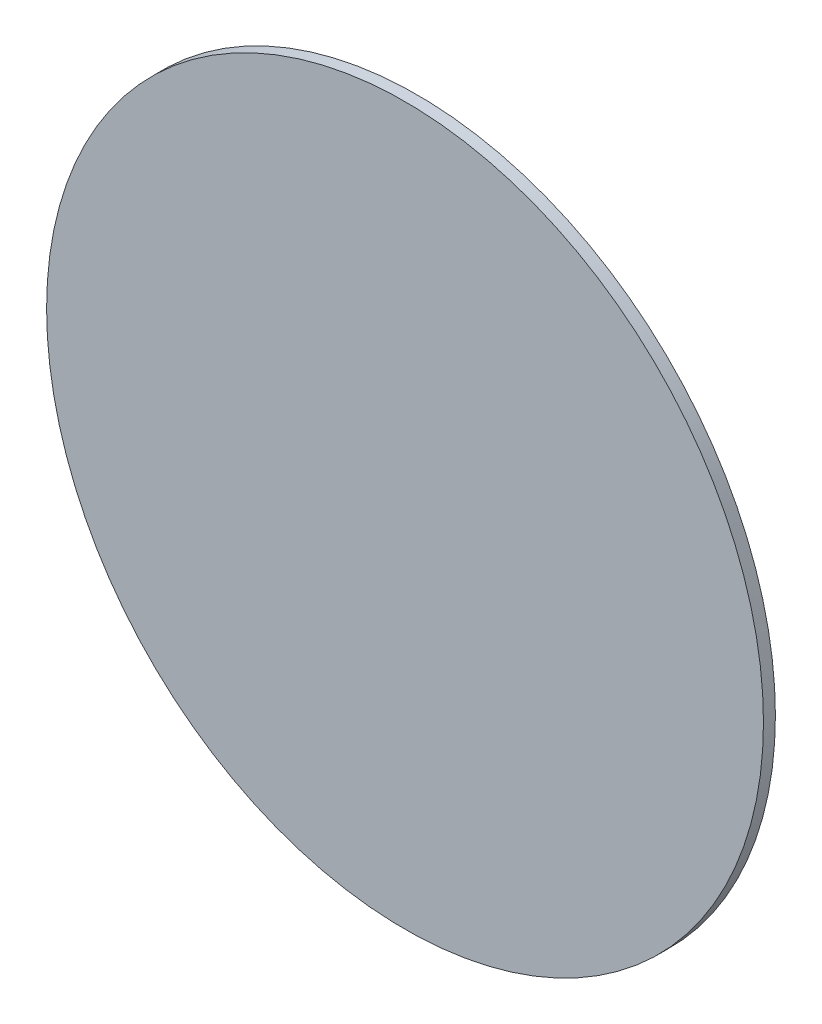
ISO-10303-21;
HEADER;
FILE_DESCRIPTION(('STEP AP214'),'2;1');
FILE_NAME('part.step','',(''),(''),'','','');
FILE_SCHEMA(('AUTOMOTIVE_DESIGN { 1 0 10303 214 1 1 1 1 }'));
ENDSEC;
DATA;
#1=APPLICATION_CONTEXT('core data for automotive mechanical design processes');
#2=APPLICATION_PROTOCOL_DEFINITION('international standard','automotive_design',2000,#1);
#3=PRODUCT_CONTEXT('',#1,'mechanical');
#4=PRODUCT('Part','Part','',(#3));
#5=PRODUCT_RELATED_PRODUCT_CATEGORY('part','',(#4));
#6=PRODUCT_DEFINITION_FORMATION('','',#4);
#7=PRODUCT_DEFINITION_CONTEXT('part definition',#1,'design');
#8=PRODUCT_DEFINITION('design','',#6,#7);
#9=PRODUCT_DEFINITION_SHAPE('','',#8);
#10=(LENGTH_UNIT() NAMED_UNIT(*) SI_UNIT(.MILLI.,.METRE.));
#11=(NAMED_UNIT(*) PLANE_ANGLE_UNIT() SI_UNIT($,.RADIAN.));
#12=(NAMED_UNIT(*) SI_UNIT($,.STERADIAN.) SOLID_ANGLE_UNIT());
#13=UNCERTAINTY_MEASURE_WITH_UNIT(LENGTH_MEASURE(1.E-05),#10,'distance_accuracy_value','');
#14=(GEOMETRIC_REPRESENTATION_CONTEXT(3) GLOBAL_UNCERTAINTY_ASSIGNED_CONTEXT((#13)) GLOBAL_UNIT_ASSIGNED_CONTEXT((#10,
#11,#12)) REPRESENTATION_CONTEXT('',''));
#15=CARTESIAN_POINT('',(0.,0.,0.));
#16=DIRECTION('',(0.,0.,1.));
#17=DIRECTION('',(1.,0.,0.));
#18=AXIS2_PLACEMENT_3D('',#15,#16,#17);
#19=CARTESIAN_POINT('',(0.,0.,0.00999998));
#20=DIRECTION('',(0.,0.,1.));
#21=DIRECTION('',(1.,0.,0.));
#22=AXIS2_PLACEMENT_3D('',#19,#20,#21);
#23=PLANE('',#22);
#24=CARTESIAN_POINT('',(0.,0.,0.00999998));
#25=DIRECTION('',(0.,0.,1.));
#26=DIRECTION('',(1.,0.,0.));
#27=AXIS2_PLACEMENT_3D('',#24,#25,#26);
#28=CIRCLE('',#27,0.2999994);
#29=CARTESIAN_POINT('',(-0.2999994,0.,0.00999998));
#30=VERTEX_POINT('',#29);
#31=EDGE_CURVE('E11',#30,#30,#28,.T.);
#32=ORIENTED_EDGE('',*,*,#31,.T.);
#33=EDGE_LOOP('',(#32));
#34=FACE_BOUND('',#33,.T.);
#35=ADVANCED_FACE('F16',(#34),#23,.T.);
#36=CARTESIAN_POINT('',(0.,0.,0.));
#37=DIRECTION('',(0.,0.,1.));
#38=DIRECTION('',(1.,0.,0.));
#39=AXIS2_PLACEMENT_3D('',#36,#37,#38);
#40=PLANE('',#39);
#41=CARTESIAN_POINT('',(0.,0.,0.));
#42=DIRECTION('',(0.,0.,1.));
#43=DIRECTION('',(1.,0.,0.));
#44=AXIS2_PLACEMENT_3D('',#41,#42,#43);
#45=CIRCLE('',#44,0.2999994);
#46=CARTESIAN_POINT('',(-0.2999994,0.,0.));
#47=VERTEX_POINT('',#46);
#48=EDGE_CURVE('E42',#47,#47,#45,.T.);
#49=ORIENTED_EDGE('',*,*,#48,.F.);
#50=EDGE_LOOP('',(#49));
#51=FACE_BOUND('',#50,.T.);
#52=ADVANCED_FACE('F58',(#51),#40,.F.);
#53=CARTESIAN_POINT('',(0.,0.,0.));
#54=DIRECTION('',(0.,0.,-1.));
#55=DIRECTION('',(1.,0.,0.));
#56=AXIS2_PLACEMENT_3D('',#53,#54,#55);
#57=CYLINDRICAL_SURFACE('',#56,0.2999994);
#58=ORIENTED_EDGE('',*,*,#48,.T.);
#59=DIRECTION('',(0.,0.,1.));
#60=VECTOR('',#59,1.);
#61=CARTESIAN_POINT('',(-0.2999994,0.,0.));
#62=LINE('',#61,#60);
#63=EDGE_CURVE('E19',#47,#30,#62,.T.);
#64=ORIENTED_EDGE('',*,*,#63,.T.);
#65=ORIENTED_EDGE('',*,*,#31,.F.);
#66=ORIENTED_EDGE('',*,*,#63,.F.);
#67=EDGE_LOOP('',(#58,#64,#65,#66));
#68=FACE_BOUND('',#67,.T.);
#69=ADVANCED_FACE('F40',(#68),#57,.T.);
#70=CLOSED_SHELL('',(#35,#52,#69));
#71=MANIFOLD_SOLID_BREP('B1',#70);
#72=ADVANCED_BREP_SHAPE_REPRESENTATION('',(#18,#71),#14);
#73=SHAPE_DEFINITION_REPRESENTATION(#9,#72);
ENDSEC;
END-ISO-10303-21;
